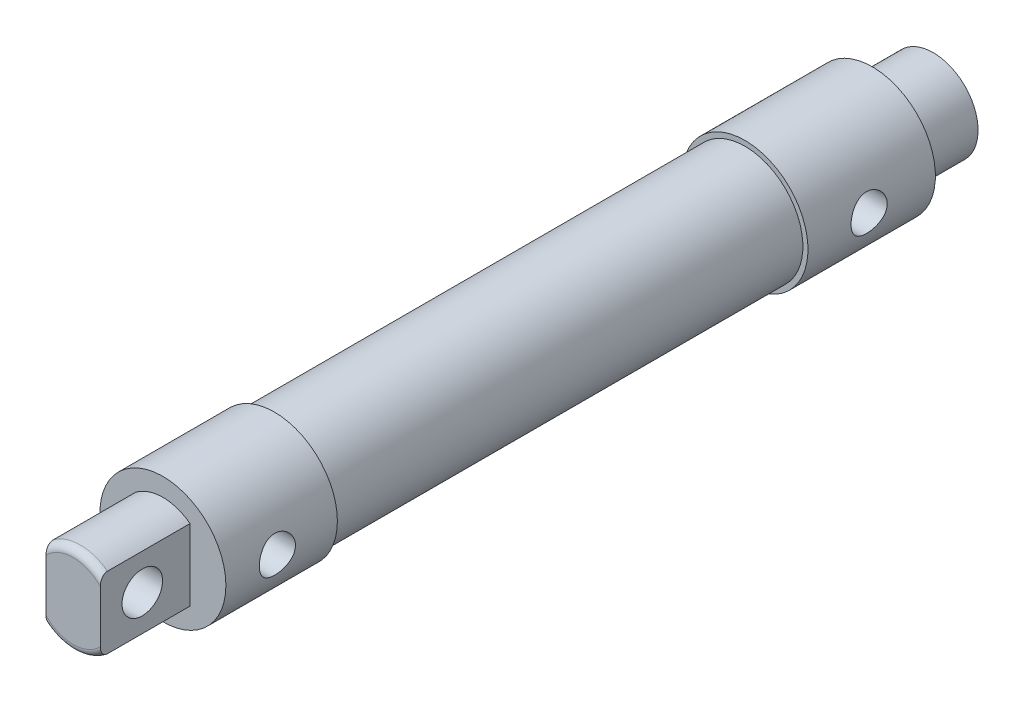
ISO-10303-21;
HEADER;
FILE_DESCRIPTION(('STEP AP214'),'2;1');
FILE_NAME('part.step','',(''),(''),'','','');
FILE_SCHEMA(('AUTOMOTIVE_DESIGN { 1 0 10303 214 1 1 1 1 }'));
ENDSEC;
DATA;
#1=APPLICATION_CONTEXT('core data for automotive mechanical design processes');
#2=APPLICATION_PROTOCOL_DEFINITION('international standard','automotive_design',2000,#1);
#3=PRODUCT_CONTEXT('',#1,'mechanical');
#4=PRODUCT('Part','Part','',(#3));
#5=PRODUCT_RELATED_PRODUCT_CATEGORY('part','',(#4));
#6=PRODUCT_DEFINITION_FORMATION('','',#4);
#7=PRODUCT_DEFINITION_CONTEXT('part definition',#1,'design');
#8=PRODUCT_DEFINITION('design','',#6,#7);
#9=PRODUCT_DEFINITION_SHAPE('','',#8);
#10=(LENGTH_UNIT() NAMED_UNIT(*) SI_UNIT(.MILLI.,.METRE.));
#11=(NAMED_UNIT(*) PLANE_ANGLE_UNIT() SI_UNIT($,.RADIAN.));
#12=(NAMED_UNIT(*) SI_UNIT($,.STERADIAN.) SOLID_ANGLE_UNIT());
#13=UNCERTAINTY_MEASURE_WITH_UNIT(LENGTH_MEASURE(1.E-05),#10,'distance_accuracy_value','');
#14=(GEOMETRIC_REPRESENTATION_CONTEXT(3) GLOBAL_UNCERTAINTY_ASSIGNED_CONTEXT((#13)) GLOBAL_UNIT_ASSIGNED_CONTEXT((#10,
#11,#12)) REPRESENTATION_CONTEXT('',''));
#15=CARTESIAN_POINT('',(0.,0.,0.));
#16=DIRECTION('',(0.,0.,1.));
#17=DIRECTION('',(1.,0.,0.));
#18=AXIS2_PLACEMENT_3D('',#15,#16,#17);
#19=CARTESIAN_POINT('',(0.,0.,102.108));
#20=DIRECTION('',(0.,0.,-1.));
#21=DIRECTION('',(-1.,0.,0.));
#22=AXIS2_PLACEMENT_3D('',#19,#20,#21);
#23=CYLINDRICAL_SURFACE('',#22,11.049);
#24=CARTESIAN_POINT('',(0.,0.,102.108));
#25=DIRECTION('',(0.,0.,1.));
#26=DIRECTION('',(1.,0.,0.));
#27=AXIS2_PLACEMENT_3D('',#24,#25,#26);
#28=CIRCLE('',#27,11.049);
#29=CARTESIAN_POINT('',(11.049,0.,102.108));
#30=VERTEX_POINT('',#29);
#31=EDGE_CURVE('E245',#30,#30,#28,.T.);
#32=ORIENTED_EDGE('',*,*,#31,.F.);
#33=EDGE_LOOP('',(#32));
#34=FACE_BOUND('',#33,.T.);
#35=CARTESIAN_POINT('',(0.,0.,82.55));
#36=DIRECTION('',(0.,0.,1.));
#37=DIRECTION('',(1.,0.,0.));
#38=AXIS2_PLACEMENT_3D('',#35,#36,#37);
#39=CIRCLE('',#38,11.049);
#40=CARTESIAN_POINT('',(11.049,0.,82.55));
#41=VERTEX_POINT('',#40);
#42=EDGE_CURVE('E246',#41,#41,#39,.T.);
#43=ORIENTED_EDGE('',*,*,#42,.T.);
#44=EDGE_LOOP('',(#43));
#45=FACE_BOUND('',#44,.T.);
#46=CARTESIAN_POINT('',(10.5829946612478,-3.175,93.0760778464226));
#47=CARTESIAN_POINT('',(10.5829970378921,-3.17499696173694,93.2504210160346));
#48=CARTESIAN_POINT('',(10.5873499628536,-3.16059101598809,93.4247947914254));
#49=CARTESIAN_POINT('',(10.6042287733974,-3.10348071440142,93.7684686648293));
#50=CARTESIAN_POINT('',(10.6167579154399,-3.06076508315063,93.9377667131465));
#51=CARTESIAN_POINT('',(10.6484555361327,-2.94858604276688,94.266265950174));
#52=CARTESIAN_POINT('',(10.6676136440502,-2.87916439519901,94.4254824534469));
#53=CARTESIAN_POINT('',(10.7103968556723,-2.71567886194747,94.7300428356047));
#54=CARTESIAN_POINT('',(10.7340225055439,-2.62161196278527,94.8753850150505));
#55=CARTESIAN_POINT('',(10.7838478929209,-2.40858326173655,95.1522908243156));
#56=CARTESIAN_POINT('',(10.8100989589948,-2.28903221307923,95.2833920018629));
#57=CARTESIAN_POINT('',(10.8617771284488,-2.02969339145336,95.5239875474528));
#58=CARTESIAN_POINT('',(10.8872041340175,-1.88990322690515,95.63347935838));
#59=CARTESIAN_POINT('',(10.9349482869144,-1.59079703436564,95.8297248552312));
#60=CARTESIAN_POINT('',(10.9571978703645,-1.43116293599986,95.9160116284078));
#61=CARTESIAN_POINT('',(10.9954868205641,-1.09890403668004,96.0603402425021));
#62=CARTESIAN_POINT('',(11.0115274108589,-0.926281803186664,96.1183876488545));
#63=CARTESIAN_POINT('',(11.0352279538983,-0.577780737066135,96.2030726139401));
#64=CARTESIAN_POINT('',(11.0430978601515,-0.402107999548981,96.2304985007207));
#65=CARTESIAN_POINT('',(11.0503076095615,-0.0484902253797742,96.2556497122282));
#66=CARTESIAN_POINT('',(11.0496491013871,0.129454365444954,96.2533807774033));
#67=CARTESIAN_POINT('',(11.0400267625263,0.477051272742408,96.2197461231162));
#68=CARTESIAN_POINT('',(11.0313063870296,0.646793905386179,96.1892332895884));
#69=CARTESIAN_POINT('',(11.0068326238017,0.978639250638321,96.1013641482073));
#70=CARTESIAN_POINT('',(10.991078806017,1.14074149541176,96.0440061989228));
#71=CARTESIAN_POINT('',(10.9539621303433,1.4547904040677,95.9034681087909));
#72=CARTESIAN_POINT('',(10.9325393858836,1.60660549873712,95.8200104285103));
#73=CARTESIAN_POINT('',(10.8863714985496,1.89435605989024,95.6298587495398));
#74=CARTESIAN_POINT('',(10.8616256211488,2.03028800319434,95.5231596104371));
#75=CARTESIAN_POINT('',(10.8104367437012,2.28750533131605,95.2850886155363));
#76=CARTESIAN_POINT('',(10.7839646808932,2.4080998224991,95.1529756044689));
#77=CARTESIAN_POINT('',(10.733084389821,2.62560689303648,94.8701356166965));
#78=CARTESIAN_POINT('',(10.7086763331534,2.72251750463204,94.7194070948998));
#79=CARTESIAN_POINT('',(10.6645569111701,2.89054812362863,94.4019229266747));
#80=CARTESIAN_POINT('',(10.6448854814472,2.96145130546496,94.2350465742272));
#81=CARTESIAN_POINT('',(10.6129476152519,3.07395555813914,93.8910300905357));
#82=CARTESIAN_POINT('',(10.6006789953196,3.11556526969433,93.7138930026082));
#83=CARTESIAN_POINT('',(10.585409663935,3.16704977828252,93.360914762678));
#84=CARTESIAN_POINT('',(10.5821046142205,3.17796715559108,93.185238699667));
#85=CARTESIAN_POINT('',(10.5842985066283,3.17065339734403,92.8345648988625));
#86=CARTESIAN_POINT('',(10.5897963357224,3.15242594683497,92.659567078117));
#87=CARTESIAN_POINT('',(10.6086796202177,3.08826497319619,92.3194335876821));
#88=CARTESIAN_POINT('',(10.6218788212302,3.04298510170739,92.1541632424752));
#89=CARTESIAN_POINT('',(10.654488955992,2.92675343849825,91.8335706419406));
#90=CARTESIAN_POINT('',(10.6739007932801,2.85579791242604,91.6782498375766));
#91=CARTESIAN_POINT('',(10.7173525725105,2.68819763195385,91.3776772532887));
#92=CARTESIAN_POINT('',(10.7414960228918,2.59095536802797,91.2327739732972));
#93=CARTESIAN_POINT('',(10.7914602367789,2.37426353068632,90.9609601536623));
#94=CARTESIAN_POINT('',(10.8172813672868,2.25480908751678,90.8340535703535));
#95=CARTESIAN_POINT('',(10.8687608358398,1.99221286364236,90.5973670912839));
#96=CARTESIAN_POINT('',(10.8943833784092,1.84840048120929,90.4883217183711));
#97=CARTESIAN_POINT('',(10.9416824947104,1.54391896032718,90.2959043170114));
#98=CARTESIAN_POINT('',(10.963359273833,1.38325069997259,90.2125309520897));
#99=CARTESIAN_POINT('',(11.0001869824692,1.05072587538093,90.0746217473224));
#100=CARTESIAN_POINT('',(11.0153871097535,0.8789655035982,90.0198677607017));
#101=CARTESIAN_POINT('',(11.0377661850788,0.528171227762893,89.9401585545153));
#102=CARTESIAN_POINT('',(11.0449472223555,0.349139230810347,89.9151955732998));
#103=CARTESIAN_POINT('',(11.0503629040812,-0.00430043148248762,89.8963271602359));
#104=CARTESIAN_POINT('',(11.0489056996126,-0.178647014664036,89.9013520194536));
#105=CARTESIAN_POINT('',(11.0379233962819,-0.523908669717691,89.9397882629655));
#106=CARTESIAN_POINT('',(11.0283986915624,-0.69482390881254,89.9731982604872));
#107=CARTESIAN_POINT('',(11.0024294098578,-1.0268668171994,90.0668151441214));
#108=CARTESIAN_POINT('',(10.9860488399852,-1.18806963267255,90.1267744555124));
#109=CARTESIAN_POINT('',(10.9480678507565,-1.49821572280081,90.2715676330534));
#110=CARTESIAN_POINT('',(10.9264666173167,-1.64715708060556,90.3564053790612));
#111=CARTESIAN_POINT('',(10.8795235460163,-1.93340384841198,90.5515049284692));
#112=CARTESIAN_POINT('',(10.8540889319086,-2.07022613928248,90.6624530931705));
#113=CARTESIAN_POINT('',(10.8026716112853,-2.32367039959812,90.9053626023441));
#114=CARTESIAN_POINT('',(10.7766887543745,-2.44028674310765,91.0373297795669));
#115=CARTESIAN_POINT('',(10.7263080053237,-2.65311527076294,91.3227581932267));
#116=CARTESIAN_POINT('',(10.7019708346248,-2.7487006048838,91.4766986591247));
#117=CARTESIAN_POINT('',(10.6585601925368,-2.91251111919759,91.7991430987811));
#118=CARTESIAN_POINT('',(10.6394838228281,-2.98075137397164,91.9676389860896));
#119=CARTESIAN_POINT('',(10.6109457090473,-3.08067604297106,92.2918605638783));
#120=CARTESIAN_POINT('',(10.6005573203454,-3.11595595609863,92.4464045642196));
#121=CARTESIAN_POINT('',(10.5865812685406,-3.16311741659185,92.7593169877032));
#122=CARTESIAN_POINT('',(10.5829925020353,-3.17500276030191,92.9176847861173));
#123=CARTESIAN_POINT('',(10.5829946612478,-3.175,93.0760778464226));
#124=B_SPLINE_CURVE_WITH_KNOTS('',3,(#46,#47,#48,#49,#50,#51,#52,#53,#54,#55,#56,#57,#58,#59,
#60,#61,#62,#63,#64,#65,#66,#67,#68,#69,#70,#71,#72,#73,#74,#75,#76,#77,#78,#79,#80,#81,#82,#83,
#84,#85,#86,#87,#88,#89,#90,#91,#92,#93,#94,#95,#96,#97,#98,#99,#100,#101,#102,#103,#104,#105,
#106,#107,#108,#109,#110,#111,#112,#113,#114,#115,#116,#117,#118,#119,#120,#121,#122,#123),
.UNSPECIFIED.,.T.,.F.,(4,2,2,2,2,2,2,2,2,2,2,2,2,2,2,2,2,2,2,2,2,2,2,2,2,2,2,2,2,2,2,2,2,2,2,2,
2,2,4),(0.,0.522445971515646,1.04510015223567,1.56694033248867,2.08884435013764,
2.62446334981218,3.16014569329022,3.70591356848465,4.25157383973313,4.78283705764741,
5.31399757604563,5.82962412489643,6.34528220559616,6.86662167203276,7.38807656264306,
7.92803521591125,8.46803871603087,9.01244709372958,9.55669481951292,10.0822178130475,
10.6076743651684,11.1209208176782,11.6342419484683,12.1603874377864,12.6866484144843,
13.230914757694,13.7751527618185,14.3151795683734,14.8550656473995,15.375811108637,
15.8965311300157,16.4124944283516,16.9285382353606,17.4600631929064,17.9917359057943,
18.5375828018549,19.0831283723763,19.5578544443061,20.0325034738991),.UNSPECIFIED.);
#125=CARTESIAN_POINT('',(10.5829946612478,-3.175,93.0760778464226));
#126=VERTEX_POINT('',#125);
#127=EDGE_CURVE('E139',#126,#126,#124,.T.);
#128=ORIENTED_EDGE('',*,*,#127,.T.);
#129=EDGE_LOOP('',(#128));
#130=FACE_BOUND('',#129,.T.);
#131=ADVANCED_FACE('F48',(#34,#45,#130),#23,.T.);
#132=CARTESIAN_POINT('',(0.,0.,91.948));
#133=DIRECTION('',(0.,0.,-1.));
#134=DIRECTION('',(-1.,0.,0.));
#135=AXIS2_PLACEMENT_3D('',#132,#133,#134);
#136=CYLINDRICAL_SURFACE('',#135,3.175);
#137=CARTESIAN_POINT('',(0.,0.,82.55));
#138=DIRECTION('',(0.,0.,1.));
#139=DIRECTION('',(1.,0.,0.));
#140=AXIS2_PLACEMENT_3D('',#137,#138,#139);
#141=CIRCLE('',#140,3.175);
#142=CARTESIAN_POINT('',(3.175,0.,82.55));
#143=VERTEX_POINT('',#142);
#144=EDGE_CURVE('E53',#143,#143,#141,.T.);
#145=ORIENTED_EDGE('',*,*,#144,.F.);
#146=EDGE_LOOP('',(#145));
#147=FACE_BOUND('',#146,.T.);
#148=CARTESIAN_POINT('',(0.,0.,93.0760778464226));
#149=DIRECTION('',(-0.707106781186548,0.,-0.707106781186547));
#150=DIRECTION('',(-0.707106781186548,0.,0.707106781186547));
#151=AXIS2_PLACEMENT_3D('',#148,#149,#150);
#152=ELLIPSE('',#151,4.49012806053458,3.175);
#153=CARTESIAN_POINT('',(1.12807784642254,-2.96783850174006,91.948));
#154=VERTEX_POINT('',#153);
#155=CARTESIAN_POINT('',(1.12807784642255,2.96783850174005,91.948));
#156=VERTEX_POINT('',#155);
#157=EDGE_CURVE('E144',#154,#156,#152,.F.);
#158=ORIENTED_EDGE('',*,*,#157,.T.);
#159=CARTESIAN_POINT('',(0.,0.,91.948));
#160=DIRECTION('',(0.,0.,-1.));
#161=DIRECTION('',(-1.,0.,0.));
#162=AXIS2_PLACEMENT_3D('',#159,#160,#161);
#163=CIRCLE('',#162,3.175);
#164=EDGE_CURVE('E149',#154,#156,#163,.T.);
#165=ORIENTED_EDGE('',*,*,#164,.F.);
#166=EDGE_LOOP('',(#158,#165));
#167=FACE_BOUND('',#166,.T.);
#168=ADVANCED_FACE('F175',(#147,#167),#136,.F.);
#169=CARTESIAN_POINT('',(0.,0.,91.948));
#170=DIRECTION('',(0.,0.,-1.));
#171=DIRECTION('',(-1.,0.,0.));
#172=AXIS2_PLACEMENT_3D('',#169,#170,#171);
#173=PLANE('',#172);
#174=DIRECTION('',(0.,1.,0.));
#175=VECTOR('',#174,1.);
#176=CARTESIAN_POINT('',(0.,0.,91.948));
#177=LINE('',#176,#175);
#178=CARTESIAN_POINT('',(0.,-2.96783850174005,91.948));
#179=VERTEX_POINT('',#178);
#180=CARTESIAN_POINT('',(0.,2.96783850174005,91.948));
#181=VERTEX_POINT('',#180);
#182=EDGE_CURVE('E138',#179,#181,#177,.T.);
#183=ORIENTED_EDGE('',*,*,#182,.F.);
#184=DIRECTION('',(-1.,0.,0.));
#185=VECTOR('',#184,1.);
#186=CARTESIAN_POINT('',(11.05,-2.96783850174005,91.948));
#187=LINE('',#186,#185);
#188=EDGE_CURVE('E69',#154,#179,#187,.T.);
#189=ORIENTED_EDGE('',*,*,#188,.F.);
#190=ORIENTED_EDGE('',*,*,#164,.T.);
#191=DIRECTION('',(-1.,0.,0.));
#192=VECTOR('',#191,1.);
#193=CARTESIAN_POINT('',(11.05,2.96783850174006,91.948));
#194=LINE('',#193,#192);
#195=EDGE_CURVE('E133',#181,#156,#194,.F.);
#196=ORIENTED_EDGE('',*,*,#195,.F.);
#197=EDGE_LOOP('',(#183,#189,#190,#196));
#198=FACE_BOUND('',#197,.T.);
#199=ADVANCED_FACE('F147',(#198),#173,.T.);
#200=CARTESIAN_POINT('',(0.,0.,102.108));
#201=DIRECTION('',(0.,0.,1.));
#202=DIRECTION('',(1.,0.,0.));
#203=AXIS2_PLACEMENT_3D('',#200,#201,#202);
#204=PLANE('',#203);
#205=ORIENTED_EDGE('',*,*,#31,.T.);
#206=EDGE_LOOP('',(#205));
#207=FACE_BOUND('',#206,.T.);
#208=DIRECTION('',(0.,-1.,0.));
#209=VECTOR('',#208,1.);
#210=CARTESIAN_POINT('',(-4.7625,-6.27044414296148,102.108));
#211=LINE('',#210,#209);
#212=CARTESIAN_POINT('',(-4.7625,6.27044414296148,102.108));
#213=VERTEX_POINT('',#212);
#214=CARTESIAN_POINT('',(-4.7625,-6.27044414296148,102.108));
#215=VERTEX_POINT('',#214);
#216=EDGE_CURVE('E274',#213,#215,#211,.T.);
#217=ORIENTED_EDGE('',*,*,#216,.F.);
#218=CARTESIAN_POINT('',(0.,0.,102.108));
#219=DIRECTION('',(0.,0.,1.));
#220=DIRECTION('',(1.,0.,0.));
#221=AXIS2_PLACEMENT_3D('',#218,#219,#220);
#222=CIRCLE('',#221,7.874);
#223=CARTESIAN_POINT('',(4.7625,6.27044414296148,102.108));
#224=VERTEX_POINT('',#223);
#225=EDGE_CURVE('E278',#224,#213,#222,.T.);
#226=ORIENTED_EDGE('',*,*,#225,.F.);
#227=DIRECTION('',(0.,1.,0.));
#228=VECTOR('',#227,1.);
#229=CARTESIAN_POINT('',(4.7625,-6.27044414296148,102.108));
#230=LINE('',#229,#228);
#231=CARTESIAN_POINT('',(4.7625,-6.27044414296148,102.108));
#232=VERTEX_POINT('',#231);
#233=EDGE_CURVE('E265',#232,#224,#230,.T.);
#234=ORIENTED_EDGE('',*,*,#233,.F.);
#235=CARTESIAN_POINT('',(0.,0.,102.108));
#236=DIRECTION('',(0.,0.,1.));
#237=DIRECTION('',(1.,0.,0.));
#238=AXIS2_PLACEMENT_3D('',#235,#236,#237);
#239=CIRCLE('',#238,7.874);
#240=EDGE_CURVE('E270',#215,#232,#239,.T.);
#241=ORIENTED_EDGE('',*,*,#240,.F.);
#242=EDGE_LOOP('',(#217,#226,#234,#241));
#243=FACE_BOUND('',#242,.T.);
#244=ADVANCED_FACE('F304',(#207,#243),#204,.T.);
#245=CARTESIAN_POINT('',(0.,0.,82.55));
#246=DIRECTION('',(0.,0.,1.));
#247=DIRECTION('',(1.,0.,0.));
#248=AXIS2_PLACEMENT_3D('',#245,#246,#247);
#249=PLANE('',#248);
#250=ORIENTED_EDGE('',*,*,#144,.T.);
#251=EDGE_LOOP('',(#250));
#252=FACE_BOUND('',#251,.T.);
#253=ORIENTED_EDGE('',*,*,#42,.F.);
#254=EDGE_LOOP('',(#253));
#255=FACE_BOUND('',#254,.T.);
#256=ADVANCED_FACE('F186',(#252,#255),#249,.F.);
#257=CARTESIAN_POINT('',(0.,0.,117.856));
#258=DIRECTION('',(0.,0.,-1.));
#259=DIRECTION('',(-1.,0.,0.));
#260=AXIS2_PLACEMENT_3D('',#257,#258,#259);
#261=CYLINDRICAL_SURFACE('',#260,7.874);
#262=DIRECTION('',(0.,0.,-1.));
#263=VECTOR('',#262,1.);
#264=CARTESIAN_POINT('',(-4.7625,6.27044414296148,117.856));
#265=LINE('',#264,#263);
#266=CARTESIAN_POINT('',(-4.7625,6.27044414296148,116.586));
#267=VERTEX_POINT('',#266);
#268=EDGE_CURVE('E249',#267,#213,#265,.T.);
#269=ORIENTED_EDGE('',*,*,#268,.F.);
#270=CARTESIAN_POINT('',(0.,0.,116.586));
#271=DIRECTION('',(0.,0.,1.));
#272=DIRECTION('',(1.,0.,0.));
#273=AXIS2_PLACEMENT_3D('',#270,#271,#272);
#274=CIRCLE('',#273,7.874);
#275=CARTESIAN_POINT('',(4.7625,6.27044414296148,116.586));
#276=VERTEX_POINT('',#275);
#277=EDGE_CURVE('E329',#267,#276,#274,.F.);
#278=ORIENTED_EDGE('',*,*,#277,.T.);
#279=DIRECTION('',(0.,0.,-1.));
#280=VECTOR('',#279,1.);
#281=CARTESIAN_POINT('',(4.7625,6.27044414296148,117.856));
#282=LINE('',#281,#280);
#283=EDGE_CURVE('E261',#276,#224,#282,.T.);
#284=ORIENTED_EDGE('',*,*,#283,.T.);
#285=ORIENTED_EDGE('',*,*,#225,.T.);
#286=EDGE_LOOP('',(#269,#278,#284,#285));
#287=FACE_BOUND('',#286,.T.);
#288=ADVANCED_FACE('F228',(#287),#261,.T.);
#289=CARTESIAN_POINT('',(-4.7625,-6.27044414296148,117.856));
#290=DIRECTION('',(1.,0.,0.));
#291=DIRECTION('',(0.,1.,0.));
#292=AXIS2_PLACEMENT_3D('',#289,#290,#291);
#293=PLANE('',#292);
#294=CARTESIAN_POINT('',(-4.7625,0.,110.49));
#295=DIRECTION('',(1.,0.,0.));
#296=DIRECTION('',(0.,1.,0.));
#297=AXIS2_PLACEMENT_3D('',#294,#295,#296);
#298=CIRCLE('',#297,3.556);
#299=CARTESIAN_POINT('',(-4.7625,3.556,110.49));
#300=VERTEX_POINT('',#299);
#301=EDGE_CURVE('E282',#300,#300,#298,.F.);
#302=ORIENTED_EDGE('',*,*,#301,.F.);
#303=EDGE_LOOP('',(#302));
#304=FACE_BOUND('',#303,.T.);
#305=DIRECTION('',(0.,-1.,0.));
#306=VECTOR('',#305,1.);
#307=CARTESIAN_POINT('',(-4.7625,-6.27044414296148,117.856));
#308=LINE('',#307,#306);
#309=CARTESIAN_POINT('',(-4.7625,4.57508576422344,117.856));
#310=VERTEX_POINT('',#309);
#311=CARTESIAN_POINT('',(-4.7625,-4.57508576422344,117.856));
#312=VERTEX_POINT('',#311);
#313=EDGE_CURVE('E269',#310,#312,#308,.T.);
#314=ORIENTED_EDGE('',*,*,#313,.F.);
#315=CARTESIAN_POINT('',(-4.7625,4.57508576422344,117.856));
#316=CARTESIAN_POINT('',(-4.7625,4.70491371485058,117.855988992306));
#317=CARTESIAN_POINT('',(-4.7625,4.83558278945041,117.84641170347));
#318=CARTESIAN_POINT('',(-4.7625,5.09465420787404,117.804901270244));
#319=CARTESIAN_POINT('',(-4.7625,5.22301707247969,117.772728857364));
#320=CARTESIAN_POINT('',(-4.7625,5.42870338399686,117.697882839221));
#321=CARTESIAN_POINT('',(-4.7625,5.50862070615666,117.662427605347));
#322=CARTESIAN_POINT('',(-4.7625,5.66172310725953,117.579556838602));
#323=CARTESIAN_POINT('',(-4.7625,5.73493413756744,117.532190319702));
#324=CARTESIAN_POINT('',(-4.7625,5.85954621136902,117.43471115017));
#325=CARTESIAN_POINT('',(-4.7625,5.91250696068593,117.386601100032));
#326=CARTESIAN_POINT('',(-4.7625,6.00991201638405,117.282266864641));
#327=CARTESIAN_POINT('',(-4.7625,6.05435186214026,117.226038456345));
#328=CARTESIAN_POINT('',(-4.7625,6.13268330527644,117.105874884677));
#329=CARTESIAN_POINT('',(-4.7625,6.16647767328858,117.041875685665));
#330=CARTESIAN_POINT('',(-4.7625,6.22061826265151,116.908469254315));
#331=CARTESIAN_POINT('',(-4.7625,6.24099787353804,116.839075933595));
#332=CARTESIAN_POINT('',(-4.7625,6.25939312554719,116.738328586812));
#333=CARTESIAN_POINT('',(-4.7625,6.26353112778692,116.708002020549));
#334=CARTESIAN_POINT('',(-4.7625,6.26905575751436,116.647123988509));
#335=CARTESIAN_POINT('',(-4.7625,6.27044458262064,116.616572721978));
#336=CARTESIAN_POINT('',(-4.7625,6.27044414296148,116.586));
#337=B_SPLINE_CURVE_WITH_KNOTS('',3,(#315,#316,#317,#318,#319,#320,#321,#322,#323,#324,#325,
#326,#327,#328,#329,#330,#331,#332,#333,#334,#335,#336),.UNSPECIFIED.,.F.,.F.,(4,2,2,2,2,2,2,2,
2,2,4),(0.,0.39051208259768,0.785223048386074,1.04660172879821,1.30692197058371,
1.52073252531684,1.7346547043959,1.95047758121078,2.16576121964784,2.25747938820261,
2.34912421005433),.UNSPECIFIED.);
#338=EDGE_CURVE('E195',#310,#267,#337,.T.);
#339=ORIENTED_EDGE('',*,*,#338,.T.);
#340=ORIENTED_EDGE('',*,*,#268,.T.);
#341=ORIENTED_EDGE('',*,*,#216,.T.);
#342=DIRECTION('',(0.,0.,-1.));
#343=VECTOR('',#342,1.);
#344=CARTESIAN_POINT('',(-4.7625,-6.27044414296148,117.856));
#345=LINE('',#344,#343);
#346=CARTESIAN_POINT('',(-4.7625,-6.27044414296148,116.586));
#347=VERTEX_POINT('',#346);
#348=EDGE_CURVE('E255',#347,#215,#345,.T.);
#349=ORIENTED_EDGE('',*,*,#348,.F.);
#350=CARTESIAN_POINT('',(-4.7625,-6.27044414296148,116.586));
#351=CARTESIAN_POINT('',(-4.7625,-6.27044695744104,116.616318737493));
#352=CARTESIAN_POINT('',(-4.7625,-6.26907969386893,116.646620938918));
#353=CARTESIAN_POINT('',(-4.7625,-6.26364600379126,116.706969671006));
#354=CARTESIAN_POINT('',(-4.7625,-6.25958072650013,116.737016305011));
#355=CARTESIAN_POINT('',(-4.7625,-6.24346537985301,116.826103039148));
#356=CARTESIAN_POINT('',(-4.7625,-6.22749460557059,116.884476323768));
#357=CARTESIAN_POINT('',(-4.7625,-6.18599695256506,116.997565139999));
#358=CARTESIAN_POINT('',(-4.7625,-6.16048225576697,117.052285230088));
#359=CARTESIAN_POINT('',(-4.7625,-6.10112984915438,117.15705512157));
#360=CARTESIAN_POINT('',(-4.7625,-6.06728241065118,117.207099368899));
#361=CARTESIAN_POINT('',(-4.7625,-5.99039711728846,117.304581778947));
#362=CARTESIAN_POINT('',(-4.7625,-5.9469247650016,117.351675051199));
#363=CARTESIAN_POINT('',(-4.7625,-5.85384044814121,117.439249704828));
#364=CARTESIAN_POINT('',(-4.7625,-5.80422853679333,117.479731143517));
#365=CARTESIAN_POINT('',(-4.7625,-5.67534049300729,117.571859726782));
#366=CARTESIAN_POINT('',(-4.7625,-5.59323792773678,117.619567571663));
#367=CARTESIAN_POINT('',(-4.7625,-5.42216260650941,117.701174178103));
#368=CARTESIAN_POINT('',(-4.7625,-5.33316043671504,117.735009459685));
#369=CARTESIAN_POINT('',(-4.7625,-5.13378043928996,117.795050891071));
#370=CARTESIAN_POINT('',(-4.7625,-5.02259523817668,117.81851969187));
#371=CARTESIAN_POINT('',(-4.7625,-4.79915137908822,117.848894386153));
#372=CARTESIAN_POINT('',(-4.7625,-4.68691720505675,117.855976060827));
#373=CARTESIAN_POINT('',(-4.7625,-4.57508576422344,117.856));
#374=B_SPLINE_CURVE_WITH_KNOTS('',3,(#350,#351,#352,#353,#354,#355,#356,#357,#358,#359,#360,
#361,#362,#363,#364,#365,#366,#367,#368,#369,#370,#371,#372,#373),.UNSPECIFIED.,.F.,.F.,(4,2,2,
2,2,2,2,2,2,2,2,4),(0.,0.0908934298733058,0.181748168669605,0.362315077107739,0.542652290896589,
0.723201059897704,0.91475718163734,1.10631164283679,1.38961771540344,1.67420608669171,
2.01378321177532,2.34970053458326),.UNSPECIFIED.);
#375=EDGE_CURVE('E231',#347,#312,#374,.T.);
#376=ORIENTED_EDGE('',*,*,#375,.T.);
#377=EDGE_LOOP('',(#314,#339,#340,#341,#349,#376));
#378=FACE_BOUND('',#377,.T.);
#379=ADVANCED_FACE('F223',(#304,#378),#293,.F.);
#380=CARTESIAN_POINT('',(0.,0.,117.856));
#381=DIRECTION('',(0.,0.,-1.));
#382=DIRECTION('',(-1.,0.,0.));
#383=AXIS2_PLACEMENT_3D('',#380,#381,#382);
#384=CYLINDRICAL_SURFACE('',#383,7.874);
#385=DIRECTION('',(0.,0.,-1.));
#386=VECTOR('',#385,1.);
#387=CARTESIAN_POINT('',(4.7625,-6.27044414296148,117.856));
#388=LINE('',#387,#386);
#389=CARTESIAN_POINT('',(4.7625,-6.27044414296148,116.586));
#390=VERTEX_POINT('',#389);
#391=EDGE_CURVE('E258',#390,#232,#388,.T.);
#392=ORIENTED_EDGE('',*,*,#391,.F.);
#393=CARTESIAN_POINT('',(0.,0.,116.586));
#394=DIRECTION('',(0.,0.,1.));
#395=DIRECTION('',(1.,0.,0.));
#396=AXIS2_PLACEMENT_3D('',#393,#394,#395);
#397=CIRCLE('',#396,7.874);
#398=EDGE_CURVE('E12',#390,#347,#397,.F.);
#399=ORIENTED_EDGE('',*,*,#398,.T.);
#400=ORIENTED_EDGE('',*,*,#348,.T.);
#401=ORIENTED_EDGE('',*,*,#240,.T.);
#402=EDGE_LOOP('',(#392,#399,#400,#401));
#403=FACE_BOUND('',#402,.T.);
#404=ADVANCED_FACE('F218',(#403),#384,.T.);
#405=CARTESIAN_POINT('',(4.7625,-6.27044414296148,117.856));
#406=DIRECTION('',(-1.,0.,0.));
#407=DIRECTION('',(0.,0.,1.));
#408=AXIS2_PLACEMENT_3D('',#405,#406,#407);
#409=PLANE('',#408);
#410=CARTESIAN_POINT('',(4.7625,0.,110.49));
#411=DIRECTION('',(1.,0.,0.));
#412=DIRECTION('',(0.,0.,-1.));
#413=AXIS2_PLACEMENT_3D('',#410,#411,#412);
#414=CIRCLE('',#413,3.556);
#415=CARTESIAN_POINT('',(4.7625,0.,106.934));
#416=VERTEX_POINT('',#415);
#417=EDGE_CURVE('E291',#416,#416,#414,.T.);
#418=ORIENTED_EDGE('',*,*,#417,.F.);
#419=EDGE_LOOP('',(#418));
#420=FACE_BOUND('',#419,.T.);
#421=ORIENTED_EDGE('',*,*,#283,.F.);
#422=CARTESIAN_POINT('',(4.7625,6.27044414296148,116.586));
#423=CARTESIAN_POINT('',(4.7625,6.27044695744104,116.616318737493));
#424=CARTESIAN_POINT('',(4.7625,6.26907969386893,116.646620938918));
#425=CARTESIAN_POINT('',(4.7625,6.26364600379127,116.706969671006));
#426=CARTESIAN_POINT('',(4.7625,6.25958072650013,116.737016305011));
#427=CARTESIAN_POINT('',(4.7625,6.24346537985301,116.826103039148));
#428=CARTESIAN_POINT('',(4.7625,6.22749460557059,116.884476323768));
#429=CARTESIAN_POINT('',(4.7625,6.18599695256506,116.997565139999));
#430=CARTESIAN_POINT('',(4.7625,6.16048225576698,117.052285230088));
#431=CARTESIAN_POINT('',(4.7625,6.1011298491544,117.15705512157));
#432=CARTESIAN_POINT('',(4.7625,6.06728241065119,117.207099368899));
#433=CARTESIAN_POINT('',(4.7625,5.99039711728846,117.304581778947));
#434=CARTESIAN_POINT('',(4.7625,5.9469247650016,117.351675051199));
#435=CARTESIAN_POINT('',(4.7625,5.85384044814121,117.439249704828));
#436=CARTESIAN_POINT('',(4.7625,5.80422853679333,117.479731143517));
#437=CARTESIAN_POINT('',(4.7625,5.6753404930073,117.571859726782));
#438=CARTESIAN_POINT('',(4.7625,5.59323792773679,117.619567571663));
#439=CARTESIAN_POINT('',(4.7625,5.42216260650943,117.701174178103));
#440=CARTESIAN_POINT('',(4.7625,5.33316043671506,117.735009459685));
#441=CARTESIAN_POINT('',(4.7625,5.13378043928998,117.795050891071));
#442=CARTESIAN_POINT('',(4.7625,5.02259523817669,117.81851969187));
#443=CARTESIAN_POINT('',(4.7625,4.79915137908822,117.848894386153));
#444=CARTESIAN_POINT('',(4.7625,4.68691720505676,117.855976060827));
#445=CARTESIAN_POINT('',(4.7625,4.57508576422344,117.856));
#446=B_SPLINE_CURVE_WITH_KNOTS('',3,(#422,#423,#424,#425,#426,#427,#428,#429,#430,#431,#432,
#433,#434,#435,#436,#437,#438,#439,#440,#441,#442,#443,#444,#445),.UNSPECIFIED.,.F.,.F.,(4,2,2,
2,2,2,2,2,2,2,2,4),(0.,0.0908934298733058,0.181748168669605,0.362315077107739,0.542652290896557,
0.723201059897703,0.914757181637344,1.10631164283678,1.38961771540342,1.67420608669169,
2.01378321177531,2.34970053458325),.UNSPECIFIED.);
#447=CARTESIAN_POINT('',(4.7625,4.57508576422344,117.856));
#448=VERTEX_POINT('',#447);
#449=EDGE_CURVE('E59',#276,#448,#446,.T.);
#450=ORIENTED_EDGE('',*,*,#449,.T.);
#451=DIRECTION('',(0.,1.,0.));
#452=VECTOR('',#451,1.);
#453=CARTESIAN_POINT('',(4.7625,-6.27044414296148,117.856));
#454=LINE('',#453,#452);
#455=CARTESIAN_POINT('',(4.7625,-4.57508576422344,117.856));
#456=VERTEX_POINT('',#455);
#457=EDGE_CURVE('E264',#456,#448,#454,.T.);
#458=ORIENTED_EDGE('',*,*,#457,.F.);
#459=CARTESIAN_POINT('',(4.7625,-4.57508576422344,117.856));
#460=CARTESIAN_POINT('',(4.7625,-4.70491371485058,117.855988992306));
#461=CARTESIAN_POINT('',(4.7625,-4.83558278945041,117.84641170347));
#462=CARTESIAN_POINT('',(4.7625,-5.09465420787404,117.804901270244));
#463=CARTESIAN_POINT('',(4.7625,-5.22301707247968,117.772728857364));
#464=CARTESIAN_POINT('',(4.7625,-5.42870338399685,117.697882839221));
#465=CARTESIAN_POINT('',(4.7625,-5.50862070615666,117.662427605347));
#466=CARTESIAN_POINT('',(4.7625,-5.66172310725953,117.579556838602));
#467=CARTESIAN_POINT('',(4.7625,-5.73493413756743,117.532190319702));
#468=CARTESIAN_POINT('',(4.7625,-5.85954621136902,117.43471115017));
#469=CARTESIAN_POINT('',(4.7625,-5.91250696068594,117.386601100032));
#470=CARTESIAN_POINT('',(4.7625,-6.00991201638405,117.282266864641));
#471=CARTESIAN_POINT('',(4.7625,-6.05435186214026,117.226038456345));
#472=CARTESIAN_POINT('',(4.7625,-6.13268330527643,117.105874884677));
#473=CARTESIAN_POINT('',(4.7625,-6.16647767328858,117.041875685665));
#474=CARTESIAN_POINT('',(4.7625,-6.22061826265151,116.908469254315));
#475=CARTESIAN_POINT('',(4.7625,-6.24099787353804,116.839075933595));
#476=CARTESIAN_POINT('',(4.7625,-6.25939312554719,116.738328586812));
#477=CARTESIAN_POINT('',(4.7625,-6.26353112778692,116.708002020549));
#478=CARTESIAN_POINT('',(4.7625,-6.26905575751435,116.647123988509));
#479=CARTESIAN_POINT('',(4.7625,-6.27044458262064,116.616572721978));
#480=CARTESIAN_POINT('',(4.7625,-6.27044414296148,116.586));
#481=B_SPLINE_CURVE_WITH_KNOTS('',3,(#459,#460,#461,#462,#463,#464,#465,#466,#467,#468,#469,
#470,#471,#472,#473,#474,#475,#476,#477,#478,#479,#480),.UNSPECIFIED.,.F.,.F.,(4,2,2,2,2,2,2,2,
2,2,4),(0.,0.390512082597678,0.785223048386074,1.04660172879821,1.30692197058371,
1.52073252531686,1.7346547043959,1.95047758121078,2.16576121964783,2.25747938820261,
2.34912421005431),.UNSPECIFIED.);
#482=EDGE_CURVE('E80',#456,#390,#481,.T.);
#483=ORIENTED_EDGE('',*,*,#482,.T.);
#484=ORIENTED_EDGE('',*,*,#391,.T.);
#485=ORIENTED_EDGE('',*,*,#233,.T.);
#486=EDGE_LOOP('',(#421,#450,#458,#483,#484,#485));
#487=FACE_BOUND('',#486,.T.);
#488=ADVANCED_FACE('F212',(#420,#487),#409,.F.);
#489=CARTESIAN_POINT('',(0.,0.,117.856));
#490=DIRECTION('',(0.,0.,1.));
#491=DIRECTION('',(1.,0.,0.));
#492=AXIS2_PLACEMENT_3D('',#489,#490,#491);
#493=PLANE('',#492);
#494=ORIENTED_EDGE('',*,*,#457,.T.);
#495=CARTESIAN_POINT('',(0.,0.,117.856));
#496=DIRECTION('',(0.,0.,1.));
#497=DIRECTION('',(1.,0.,0.));
#498=AXIS2_PLACEMENT_3D('',#495,#496,#497);
#499=CIRCLE('',#498,6.604);
#500=EDGE_CURVE('E237',#448,#310,#499,.T.);
#501=ORIENTED_EDGE('',*,*,#500,.T.);
#502=ORIENTED_EDGE('',*,*,#313,.T.);
#503=CARTESIAN_POINT('',(0.,0.,117.856));
#504=DIRECTION('',(0.,0.,1.));
#505=DIRECTION('',(1.,0.,0.));
#506=AXIS2_PLACEMENT_3D('',#503,#504,#505);
#507=CIRCLE('',#506,6.604);
#508=EDGE_CURVE('E241',#312,#456,#507,.T.);
#509=ORIENTED_EDGE('',*,*,#508,.T.);
#510=EDGE_LOOP('',(#494,#501,#502,#509));
#511=FACE_BOUND('',#510,.T.);
#512=ADVANCED_FACE('F217',(#511),#493,.T.);
#513=CARTESIAN_POINT('',(-11.05,0.,110.49));
#514=DIRECTION('',(1.,0.,0.));
#515=DIRECTION('',(0.,0.,-1.));
#516=AXIS2_PLACEMENT_3D('',#513,#514,#515);
#517=CYLINDRICAL_SURFACE('',#516,3.556);
#518=ORIENTED_EDGE('',*,*,#417,.T.);
#519=EDGE_LOOP('',(#518));
#520=FACE_BOUND('',#519,.T.);
#521=ORIENTED_EDGE('',*,*,#301,.T.);
#522=EDGE_LOOP('',(#521));
#523=FACE_BOUND('',#522,.T.);
#524=ADVANCED_FACE('F191',(#520,#523),#517,.F.);
#525=CARTESIAN_POINT('',(0.,0.,116.586));
#526=DIRECTION('',(0.,0.,1.));
#527=DIRECTION('',(1.,0.,0.));
#528=AXIS2_PLACEMENT_3D('',#525,#526,#527);
#529=TOROIDAL_SURFACE('',#528,6.604,1.27);
#530=ORIENTED_EDGE('',*,*,#449,.F.);
#531=ORIENTED_EDGE('',*,*,#277,.F.);
#532=ORIENTED_EDGE('',*,*,#338,.F.);
#533=ORIENTED_EDGE('',*,*,#500,.F.);
#534=EDGE_LOOP('',(#530,#531,#532,#533));
#535=FACE_BOUND('',#534,.T.);
#536=ADVANCED_FACE('F188',(#535),#529,.T.);
#537=CARTESIAN_POINT('',(0.,0.,116.586));
#538=DIRECTION('',(0.,0.,1.));
#539=DIRECTION('',(1.,0.,0.));
#540=AXIS2_PLACEMENT_3D('',#537,#538,#539);
#541=TOROIDAL_SURFACE('',#540,6.604,1.27);
#542=ORIENTED_EDGE('',*,*,#375,.F.);
#543=ORIENTED_EDGE('',*,*,#398,.F.);
#544=ORIENTED_EDGE('',*,*,#482,.F.);
#545=ORIENTED_EDGE('',*,*,#508,.F.);
#546=EDGE_LOOP('',(#542,#543,#544,#545));
#547=FACE_BOUND('',#546,.T.);
#548=ADVANCED_FACE('F50',(#547),#541,.T.);
#549=CARTESIAN_POINT('',(11.05,0.,93.0760778464226));
#550=DIRECTION('',(-1.,0.,0.));
#551=DIRECTION('',(0.,-1.,0.));
#552=AXIS2_PLACEMENT_3D('',#549,#550,#551);
#553=CYLINDRICAL_SURFACE('',#552,3.175);
#554=ORIENTED_EDGE('',*,*,#188,.T.);
#555=CARTESIAN_POINT('',(0.,0.,93.0760778464226));
#556=DIRECTION('',(1.,0.,0.));
#557=DIRECTION('',(0.,1.,0.));
#558=AXIS2_PLACEMENT_3D('',#555,#556,#557);
#559=CIRCLE('',#558,3.175);
#560=EDGE_CURVE('E128',#181,#179,#559,.T.);
#561=ORIENTED_EDGE('',*,*,#560,.F.);
#562=ORIENTED_EDGE('',*,*,#195,.T.);
#563=ORIENTED_EDGE('',*,*,#157,.F.);
#564=EDGE_LOOP('',(#554,#561,#562,#563));
#565=FACE_BOUND('',#564,.T.);
#566=ORIENTED_EDGE('',*,*,#127,.F.);
#567=EDGE_LOOP('',(#566));
#568=FACE_BOUND('',#567,.T.);
#569=ADVANCED_FACE('F130',(#565,#568),#553,.F.);
#570=CARTESIAN_POINT('',(0.,0.,93.0760778464226));
#571=DIRECTION('',(1.,0.,0.));
#572=DIRECTION('',(0.,1.,0.));
#573=AXIS2_PLACEMENT_3D('',#570,#571,#572);
#574=PLANE('',#573);
#575=ORIENTED_EDGE('',*,*,#182,.T.);
#576=ORIENTED_EDGE('',*,*,#560,.T.);
#577=EDGE_LOOP('',(#575,#576));
#578=FACE_BOUND('',#577,.T.);
#579=ADVANCED_FACE('F141',(#578),#574,.T.);
#580=CLOSED_SHELL('',(#131,#168,#199,#244,#256,#288,#379,#404,#488,#512,#524,#536,#548,#569,#579));
#581=MANIFOLD_SOLID_BREP('B2',#580);
#582=CARTESIAN_POINT('',(0.,0.,-22.352));
#583=DIRECTION('',(0.,0.,1.));
#584=DIRECTION('',(1.,0.,0.));
#585=AXIS2_PLACEMENT_3D('',#582,#583,#584);
#586=CYLINDRICAL_SURFACE('',#585,11.049);
#587=CARTESIAN_POINT('',(0.,0.,-22.352));
#588=DIRECTION('',(0.,0.,-1.));
#589=DIRECTION('',(-1.,0.,0.));
#590=AXIS2_PLACEMENT_3D('',#587,#588,#589);
#591=CIRCLE('',#590,11.049);
#592=CARTESIAN_POINT('',(-11.049,0.,-22.352));
#593=VERTEX_POINT('',#592);
#594=EDGE_CURVE('E509',#593,#593,#591,.T.);
#595=ORIENTED_EDGE('',*,*,#594,.F.);
#596=EDGE_LOOP('',(#595));
#597=FACE_BOUND('',#596,.T.);
#598=CARTESIAN_POINT('',(0.,0.,0.));
#599=DIRECTION('',(0.,0.,-1.));
#600=DIRECTION('',(-1.,0.,0.));
#601=AXIS2_PLACEMENT_3D('',#598,#599,#600);
#602=CIRCLE('',#601,11.049);
#603=CARTESIAN_POINT('',(-11.049,0.,0.));
#604=VERTEX_POINT('',#603);
#605=EDGE_CURVE('E513',#604,#604,#602,.T.);
#606=ORIENTED_EDGE('',*,*,#605,.T.);
#607=EDGE_LOOP('',(#606));
#608=FACE_BOUND('',#607,.T.);
#609=CARTESIAN_POINT('',(10.5829946612478,-3.175,-10.7397975431835));
#610=CARTESIAN_POINT('',(10.5829970378921,-3.17499696173694,-10.5654543735715));
#611=CARTESIAN_POINT('',(10.5873499628536,-3.16059101598809,-10.3910805981808));
#612=CARTESIAN_POINT('',(10.6042287733974,-3.10348071440142,-10.0474067247768));
#613=CARTESIAN_POINT('',(10.6167579154399,-3.06076508315063,-9.8781086764596));
#614=CARTESIAN_POINT('',(10.6484555361327,-2.94858604276688,-9.54960943943213));
#615=CARTESIAN_POINT('',(10.6676136440502,-2.87916439519901,-9.39039293615923));
#616=CARTESIAN_POINT('',(10.7103968556723,-2.71567886194747,-9.08583255400147));
#617=CARTESIAN_POINT('',(10.7340225055439,-2.62161196278527,-8.94049037455566));
#618=CARTESIAN_POINT('',(10.7838478929209,-2.40858326173655,-8.6635845652905));
#619=CARTESIAN_POINT('',(10.8100989589948,-2.28903221307923,-8.53248338774322));
#620=CARTESIAN_POINT('',(10.8617771284488,-2.02969339145336,-8.29188784215332));
#621=CARTESIAN_POINT('',(10.8872041340175,-1.88990322690514,-8.18239603122611));
#622=CARTESIAN_POINT('',(10.9349482869144,-1.59079703436564,-7.98615053437497));
#623=CARTESIAN_POINT('',(10.9571978703645,-1.43116293599986,-7.89986376119828));
#624=CARTESIAN_POINT('',(10.9954868205641,-1.09890403668005,-7.75553514710404));
#625=CARTESIAN_POINT('',(11.0115274108589,-0.926281803186664,-7.69748774075162));
#626=CARTESIAN_POINT('',(11.0352279538983,-0.577780737066133,-7.61280277566601));
#627=CARTESIAN_POINT('',(11.0430978601515,-0.40210799954898,-7.58537688888545));
#628=CARTESIAN_POINT('',(11.0503076095615,-0.0484902253797718,-7.56022567737788));
#629=CARTESIAN_POINT('',(11.0496491013871,0.129454365444957,-7.56249461220288));
#630=CARTESIAN_POINT('',(11.0400267625263,0.477051272742411,-7.59612926648995));
#631=CARTESIAN_POINT('',(11.0313063870296,0.646793905386182,-7.62664210001776));
#632=CARTESIAN_POINT('',(11.0068326238017,0.978639250638324,-7.71451124139882));
#633=CARTESIAN_POINT('',(10.991078806017,1.14074149541176,-7.77186919068333));
#634=CARTESIAN_POINT('',(10.9539621303433,1.4547904040677,-7.91240728081524));
#635=CARTESIAN_POINT('',(10.9325393858836,1.60660549873712,-7.99586496109587));
#636=CARTESIAN_POINT('',(10.8863714985496,1.89435605989024,-8.18601664006632));
#637=CARTESIAN_POINT('',(10.8616256211488,2.03028800319434,-8.29271577916901));
#638=CARTESIAN_POINT('',(10.8104367437012,2.28750533131605,-8.53078677406985));
#639=CARTESIAN_POINT('',(10.7839646808932,2.4080998224991,-8.66289978513723));
#640=CARTESIAN_POINT('',(10.733084389821,2.62560689303649,-8.94573977290962));
#641=CARTESIAN_POINT('',(10.7086763331534,2.72251750463205,-9.09646829470636));
#642=CARTESIAN_POINT('',(10.6645569111701,2.89054812362863,-9.41395246293139));
#643=CARTESIAN_POINT('',(10.6448854814472,2.96145130546497,-9.58082881537895));
#644=CARTESIAN_POINT('',(10.6129476152519,3.07395555813915,-9.9248452990704));
#645=CARTESIAN_POINT('',(10.6006789953196,3.11556526969434,-10.1019823869979));
#646=CARTESIAN_POINT('',(10.585409663935,3.16704977828252,-10.4549606269282));
#647=CARTESIAN_POINT('',(10.5821046142205,3.17796715559108,-10.6306366899391));
#648=CARTESIAN_POINT('',(10.5842985066283,3.17065339734403,-10.9813104907436));
#649=CARTESIAN_POINT('',(10.5897963357224,3.15242594683498,-11.1563083114892));
#650=CARTESIAN_POINT('',(10.6086796202177,3.0882649731962,-11.496441801924));
#651=CARTESIAN_POINT('',(10.6218788212302,3.04298510170739,-11.6617121471309));
#652=CARTESIAN_POINT('',(10.654488955992,2.92675343849825,-11.9823047476655));
#653=CARTESIAN_POINT('',(10.6739007932801,2.85579791242604,-12.1376255520295));
#654=CARTESIAN_POINT('',(10.7173525725105,2.68819763195385,-12.4381981363175));
#655=CARTESIAN_POINT('',(10.7414960228918,2.59095536802797,-12.583101416309));
#656=CARTESIAN_POINT('',(10.7914602367789,2.37426353068632,-12.8549152359438));
#657=CARTESIAN_POINT('',(10.8172813672868,2.25480908751678,-12.9818218192526));
#658=CARTESIAN_POINT('',(10.8687608358398,1.99221286364236,-13.2185082983223));
#659=CARTESIAN_POINT('',(10.8943833784092,1.84840048120928,-13.327553671235));
#660=CARTESIAN_POINT('',(10.9416824947104,1.54391896032718,-13.5199710725948));
#661=CARTESIAN_POINT('',(10.963359273833,1.38325069997259,-13.6033444375164));
#662=CARTESIAN_POINT('',(11.0001869824692,1.05072587538093,-13.7412536422838));
#663=CARTESIAN_POINT('',(11.0153871097535,0.878965503598196,-13.7960076289044));
#664=CARTESIAN_POINT('',(11.0377661850788,0.528171227762888,-13.8757168350909));
#665=CARTESIAN_POINT('',(11.0449472223555,0.349139230810344,-13.9006798163064));
#666=CARTESIAN_POINT('',(11.0503629040812,-0.00430043148248949,-13.9195482293702));
#667=CARTESIAN_POINT('',(11.0489056996126,-0.178647014664038,-13.9145233701525));
#668=CARTESIAN_POINT('',(11.0379233962819,-0.523908669717694,-13.8760871266407));
#669=CARTESIAN_POINT('',(11.0283986915624,-0.694823908812544,-13.8426771291189));
#670=CARTESIAN_POINT('',(11.0024294098578,-1.02686681719941,-13.7490602454847));
#671=CARTESIAN_POINT('',(10.9860488399852,-1.18806963267256,-13.6891009340937));
#672=CARTESIAN_POINT('',(10.9480678507565,-1.49821572280081,-13.5443077565527));
#673=CARTESIAN_POINT('',(10.9264666173167,-1.64715708060556,-13.4594700105449));
#674=CARTESIAN_POINT('',(10.8795235460163,-1.93340384841199,-13.2643704611369));
#675=CARTESIAN_POINT('',(10.8540889319086,-2.07022613928248,-13.1534222964356));
#676=CARTESIAN_POINT('',(10.8026716112853,-2.32367039959813,-12.9105127872621));
#677=CARTESIAN_POINT('',(10.7766887543745,-2.44028674310766,-12.7785456100392));
#678=CARTESIAN_POINT('',(10.7263080053237,-2.65311527076294,-12.4931171963795));
#679=CARTESIAN_POINT('',(10.7019708346248,-2.74870060488379,-12.3391767304814));
#680=CARTESIAN_POINT('',(10.6585601925368,-2.91251111919758,-12.016732290825));
#681=CARTESIAN_POINT('',(10.6394838228281,-2.98075137397164,-11.8482364035165));
#682=CARTESIAN_POINT('',(10.6109457090473,-3.08067604297106,-11.5240148257279));
#683=CARTESIAN_POINT('',(10.6005573203454,-3.11595595609863,-11.3694708253865));
#684=CARTESIAN_POINT('',(10.5865812685406,-3.16311741659185,-11.0565584019029));
#685=CARTESIAN_POINT('',(10.5829925020353,-3.17500276030191,-10.8981906034888));
#686=CARTESIAN_POINT('',(10.5829946612478,-3.175,-10.7397975431835));
#687=B_SPLINE_CURVE_WITH_KNOTS('',3,(#609,#610,#611,#612,#613,#614,#615,#616,#617,#618,#619,
#620,#621,#622,#623,#624,#625,#626,#627,#628,#629,#630,#631,#632,#633,#634,#635,#636,#637,#638,
#639,#640,#641,#642,#643,#644,#645,#646,#647,#648,#649,#650,#651,#652,#653,#654,#655,#656,#657,
#658,#659,#660,#661,#662,#663,#664,#665,#666,#667,#668,#669,#670,#671,#672,#673,#674,#675,#676,
#677,#678,#679,#680,#681,#682,#683,#684,#685,#686),.UNSPECIFIED.,.T.,.F.,(4,2,2,2,2,2,2,2,2,2,2,
2,2,2,2,2,2,2,2,2,2,2,2,2,2,2,2,2,2,2,2,2,2,2,2,2,2,2,4),(0.,0.52244597151565,1.04510015223567,
1.56694033248867,2.08884435013764,2.6244633498122,3.16014569329022,3.70591356848466,
4.25157383973314,4.78283705764742,5.31399757604564,5.82962412489644,6.34528220559617,
6.86662167203276,7.38807656264306,7.92803521591126,8.46803871603088,9.01244709372958,
9.55669481951293,10.0822178130475,10.6076743651684,11.1209208176782,11.6342419484684,
12.1603874377864,12.6866484144844,13.230914757694,13.7751527618185,14.3151795683734,
14.8550656473995,15.375811108637,15.8965311300157,16.4124944283517,16.9285382353607,
17.4600631929064,17.9917359057943,18.5375828018549,19.0831283723763,19.5578544443061,
20.0325034738991),.UNSPECIFIED.);
#688=CARTESIAN_POINT('',(10.5829946612478,-3.175,-10.7397975431835));
#689=VERTEX_POINT('',#688);
#690=EDGE_CURVE('E456',#689,#689,#687,.T.);
#691=ORIENTED_EDGE('',*,*,#690,.T.);
#692=EDGE_LOOP('',(#691));
#693=FACE_BOUND('',#692,.T.);
#694=ADVANCED_FACE('F429',(#597,#608,#693),#586,.T.);
#695=CARTESIAN_POINT('',(0.,0.,91.948));
#696=DIRECTION('',(0.,0.,-1.));
#697=DIRECTION('',(-1.,0.,0.));
#698=AXIS2_PLACEMENT_3D('',#695,#696,#697);
#699=CYLINDRICAL_SURFACE('',#698,3.175);
#700=CARTESIAN_POINT('',(0.,0.,-33.02));
#701=DIRECTION('',(0.,0.,-1.));
#702=DIRECTION('',(-1.,0.,0.));
#703=AXIS2_PLACEMENT_3D('',#700,#701,#702);
#704=CIRCLE('',#703,3.175);
#705=CARTESIAN_POINT('',(-3.175,0.,-33.02));
#706=VERTEX_POINT('',#705);
#707=EDGE_CURVE('E460',#706,#706,#704,.T.);
#708=ORIENTED_EDGE('',*,*,#707,.T.);
#709=EDGE_LOOP('',(#708));
#710=FACE_BOUND('',#709,.T.);
#711=CARTESIAN_POINT('',(0.,0.,82.55));
#712=DIRECTION('',(0.,0.,1.));
#713=DIRECTION('',(1.,0.,0.));
#714=AXIS2_PLACEMENT_3D('',#711,#712,#713);
#715=CIRCLE('',#714,3.175);
#716=CARTESIAN_POINT('',(3.175,0.,82.55));
#717=VERTEX_POINT('',#716);
#718=EDGE_CURVE('E503',#717,#717,#715,.T.);
#719=ORIENTED_EDGE('',*,*,#718,.T.);
#720=EDGE_LOOP('',(#719));
#721=FACE_BOUND('',#720,.T.);
#722=CARTESIAN_POINT('',(0.,0.,-10.7397975431835));
#723=DIRECTION('',(-0.707106781186548,0.,-0.707106781186547));
#724=DIRECTION('',(-0.707106781186548,0.,0.707106781186547));
#725=AXIS2_PLACEMENT_3D('',#722,#723,#724);
#726=ELLIPSE('',#725,4.49012806053458,3.175);
#727=CARTESIAN_POINT('',(0.,-3.175,-10.7397975431835));
#728=VERTEX_POINT('',#727);
#729=CARTESIAN_POINT('',(0.,3.175,-10.7397975431835));
#730=VERTEX_POINT('',#729);
#731=EDGE_CURVE('E446',#728,#730,#726,.F.);
#732=ORIENTED_EDGE('',*,*,#731,.T.);
#733=CARTESIAN_POINT('',(0.,0.,-10.7397975431835));
#734=DIRECTION('',(-0.707106781186548,0.,0.707106781186547));
#735=DIRECTION('',(-0.707106781186548,0.,-0.707106781186547));
#736=AXIS2_PLACEMENT_3D('',#733,#734,#735);
#737=ELLIPSE('',#736,4.49012806053458,3.175);
#738=EDGE_CURVE('E448',#730,#728,#737,.F.);
#739=ORIENTED_EDGE('',*,*,#738,.T.);
#740=EDGE_LOOP('',(#732,#739));
#741=FACE_BOUND('',#740,.T.);
#742=ADVANCED_FACE('F454',(#710,#721,#741),#699,.F.);
#743=CARTESIAN_POINT('',(0.,0.,82.55));
#744=DIRECTION('',(0.,0.,-1.));
#745=DIRECTION('',(-1.,0.,0.));
#746=AXIS2_PLACEMENT_3D('',#743,#744,#745);
#747=CYLINDRICAL_SURFACE('',#746,10.16);
#748=CARTESIAN_POINT('',(0.,0.,82.55));
#749=DIRECTION('',(0.,0.,1.));
#750=DIRECTION('',(1.,0.,0.));
#751=AXIS2_PLACEMENT_3D('',#748,#749,#750);
#752=CIRCLE('',#751,10.16);
#753=CARTESIAN_POINT('',(10.16,0.,82.55));
#754=VERTEX_POINT('',#753);
#755=EDGE_CURVE('E46',#754,#754,#752,.T.);
#756=ORIENTED_EDGE('',*,*,#755,.F.);
#757=EDGE_LOOP('',(#756));
#758=FACE_BOUND('',#757,.T.);
#759=CARTESIAN_POINT('',(0.,0.,0.));
#760=DIRECTION('',(0.,0.,-1.));
#761=DIRECTION('',(-1.,0.,0.));
#762=AXIS2_PLACEMENT_3D('',#759,#760,#761);
#763=CIRCLE('',#762,10.16);
#764=CARTESIAN_POINT('',(-10.16,0.,0.));
#765=VERTEX_POINT('',#764);
#766=EDGE_CURVE('E438',#765,#765,#763,.T.);
#767=ORIENTED_EDGE('',*,*,#766,.F.);
#768=EDGE_LOOP('',(#767));
#769=FACE_BOUND('',#768,.T.);
#770=ADVANCED_FACE('F431',(#758,#769),#747,.T.);
#771=CARTESIAN_POINT('',(0.,0.,82.55));
#772=DIRECTION('',(0.,0.,1.));
#773=DIRECTION('',(1.,0.,0.));
#774=AXIS2_PLACEMENT_3D('',#771,#772,#773);
#775=PLANE('',#774);
#776=ORIENTED_EDGE('',*,*,#718,.F.);
#777=EDGE_LOOP('',(#776));
#778=FACE_BOUND('',#777,.T.);
#779=ORIENTED_EDGE('',*,*,#755,.T.);
#780=EDGE_LOOP('',(#779));
#781=FACE_BOUND('',#780,.T.);
#782=ADVANCED_FACE('F487',(#778,#781),#775,.T.);
#783=CARTESIAN_POINT('',(0.,0.,-22.352));
#784=DIRECTION('',(0.,0.,-1.));
#785=DIRECTION('',(-1.,0.,0.));
#786=AXIS2_PLACEMENT_3D('',#783,#784,#785);
#787=PLANE('',#786);
#788=CARTESIAN_POINT('',(0.,0.,-22.352));
#789=DIRECTION('',(0.,0.,-1.));
#790=DIRECTION('',(-1.,0.,0.));
#791=AXIS2_PLACEMENT_3D('',#788,#789,#790);
#792=CIRCLE('',#791,7.874);
#793=CARTESIAN_POINT('',(-7.874,0.,-22.352));
#794=VERTEX_POINT('',#793);
#795=EDGE_CURVE('E519',#794,#794,#792,.T.);
#796=ORIENTED_EDGE('',*,*,#795,.F.);
#797=EDGE_LOOP('',(#796));
#798=FACE_BOUND('',#797,.T.);
#799=ORIENTED_EDGE('',*,*,#594,.T.);
#800=EDGE_LOOP('',(#799));
#801=FACE_BOUND('',#800,.T.);
#802=ADVANCED_FACE('F484',(#798,#801),#787,.T.);
#803=CARTESIAN_POINT('',(0.,0.,0.));
#804=DIRECTION('',(0.,0.,-1.));
#805=DIRECTION('',(-1.,0.,0.));
#806=AXIS2_PLACEMENT_3D('',#803,#804,#805);
#807=PLANE('',#806);
#808=ORIENTED_EDGE('',*,*,#766,.T.);
#809=EDGE_LOOP('',(#808));
#810=FACE_BOUND('',#809,.T.);
#811=ORIENTED_EDGE('',*,*,#605,.F.);
#812=EDGE_LOOP('',(#811));
#813=FACE_BOUND('',#812,.T.);
#814=ADVANCED_FACE('F482',(#810,#813),#807,.F.);
#815=CARTESIAN_POINT('',(0.,0.,-33.02));
#816=DIRECTION('',(0.,0.,1.));
#817=DIRECTION('',(1.,0.,0.));
#818=AXIS2_PLACEMENT_3D('',#815,#816,#817);
#819=CYLINDRICAL_SURFACE('',#818,7.874);
#820=CARTESIAN_POINT('',(0.,0.,-33.02));
#821=DIRECTION('',(0.,0.,-1.));
#822=DIRECTION('',(-1.,0.,0.));
#823=AXIS2_PLACEMENT_3D('',#820,#821,#822);
#824=CIRCLE('',#823,7.874);
#825=CARTESIAN_POINT('',(-7.874,0.,-33.02));
#826=VERTEX_POINT('',#825);
#827=EDGE_CURVE('E517',#826,#826,#824,.T.);
#828=ORIENTED_EDGE('',*,*,#827,.F.);
#829=EDGE_LOOP('',(#828));
#830=FACE_BOUND('',#829,.T.);
#831=ORIENTED_EDGE('',*,*,#795,.T.);
#832=EDGE_LOOP('',(#831));
#833=FACE_BOUND('',#832,.T.);
#834=ADVANCED_FACE('F478',(#830,#833),#819,.T.);
#835=CARTESIAN_POINT('',(0.,0.,-33.02));
#836=DIRECTION('',(0.,0.,-1.));
#837=DIRECTION('',(-1.,0.,0.));
#838=AXIS2_PLACEMENT_3D('',#835,#836,#837);
#839=PLANE('',#838);
#840=ORIENTED_EDGE('',*,*,#707,.F.);
#841=EDGE_LOOP('',(#840));
#842=FACE_BOUND('',#841,.T.);
#843=ORIENTED_EDGE('',*,*,#827,.T.);
#844=EDGE_LOOP('',(#843));
#845=FACE_BOUND('',#844,.T.);
#846=ADVANCED_FACE('F472',(#842,#845),#839,.T.);
#847=CARTESIAN_POINT('',(11.05,0.,-10.7397975431835));
#848=DIRECTION('',(-1.,0.,0.));
#849=DIRECTION('',(0.,-1.,0.));
#850=AXIS2_PLACEMENT_3D('',#847,#848,#849);
#851=CYLINDRICAL_SURFACE('',#850,3.175);
#852=ORIENTED_EDGE('',*,*,#738,.F.);
#853=ORIENTED_EDGE('',*,*,#731,.F.);
#854=EDGE_LOOP('',(#852,#853));
#855=FACE_BOUND('',#854,.T.);
#856=ORIENTED_EDGE('',*,*,#690,.F.);
#857=EDGE_LOOP('',(#856));
#858=FACE_BOUND('',#857,.T.);
#859=ADVANCED_FACE('F449',(#855,#858),#851,.F.);
#860=CLOSED_SHELL('',(#694,#742,#770,#782,#802,#814,#834,#846,#859));
#861=MANIFOLD_SOLID_BREP('B6',#860);
#862=ADVANCED_BREP_SHAPE_REPRESENTATION('',(#18,#581,#861),#14);
#863=SHAPE_DEFINITION_REPRESENTATION(#9,#862);
ENDSEC;
END-ISO-10303-21;
